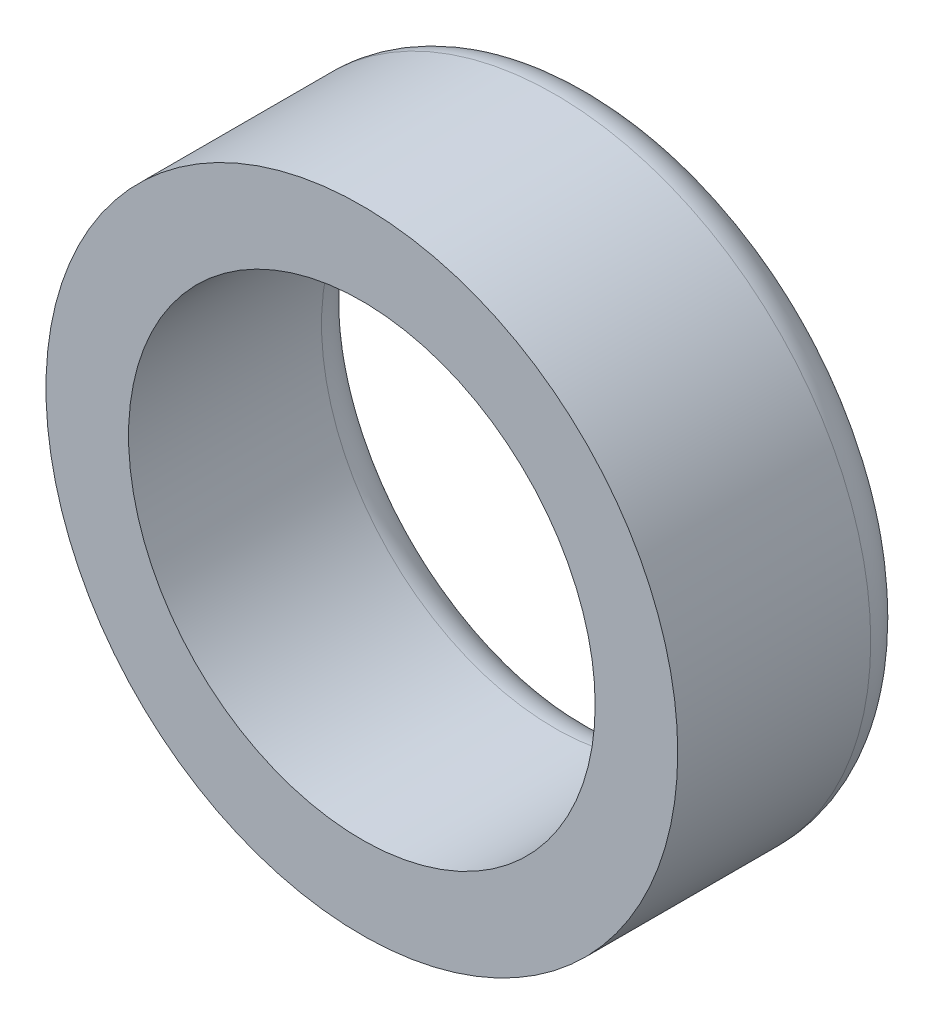
ISO-10303-21;
HEADER;
FILE_DESCRIPTION(('STEP AP214'),'2;1');
FILE_NAME('part.step','',(''),(''),'','','');
FILE_SCHEMA(('AUTOMOTIVE_DESIGN { 1 0 10303 214 1 1 1 1 }'));
ENDSEC;
DATA;
#1=APPLICATION_CONTEXT('core data for automotive mechanical design processes');
#2=APPLICATION_PROTOCOL_DEFINITION('international standard','automotive_design',2000,#1);
#3=PRODUCT_CONTEXT('',#1,'mechanical');
#4=PRODUCT('Part','Part','',(#3));
#5=PRODUCT_RELATED_PRODUCT_CATEGORY('part','',(#4));
#6=PRODUCT_DEFINITION_FORMATION('','',#4);
#7=PRODUCT_DEFINITION_CONTEXT('part definition',#1,'design');
#8=PRODUCT_DEFINITION('design','',#6,#7);
#9=PRODUCT_DEFINITION_SHAPE('','',#8);
#10=(LENGTH_UNIT() NAMED_UNIT(*) SI_UNIT(.MILLI.,.METRE.));
#11=(NAMED_UNIT(*) PLANE_ANGLE_UNIT() SI_UNIT($,.RADIAN.));
#12=(NAMED_UNIT(*) SI_UNIT($,.STERADIAN.) SOLID_ANGLE_UNIT());
#13=UNCERTAINTY_MEASURE_WITH_UNIT(LENGTH_MEASURE(1.E-05),#10,'distance_accuracy_value','');
#14=(GEOMETRIC_REPRESENTATION_CONTEXT(3) GLOBAL_UNCERTAINTY_ASSIGNED_CONTEXT((#13)) GLOBAL_UNIT_ASSIGNED_CONTEXT((#10,
#11,#12)) REPRESENTATION_CONTEXT('',''));
#15=CARTESIAN_POINT('',(0.,0.,0.));
#16=DIRECTION('',(0.,0.,1.));
#17=DIRECTION('',(1.,0.,0.));
#18=AXIS2_PLACEMENT_3D('',#15,#16,#17);
#19=CARTESIAN_POINT('',(0.,0.,-5.025));
#20=DIRECTION('',(0.,0.,1.));
#21=DIRECTION('',(1.,0.,0.));
#22=AXIS2_PLACEMENT_3D('',#19,#20,#21);
#23=TOROIDAL_SURFACE('',#22,7.15,1.075);
#24=CARTESIAN_POINT('',(0.,0.,-5.025));
#25=DIRECTION('',(0.,0.,1.));
#26=DIRECTION('',(1.,0.,0.));
#27=AXIS2_PLACEMENT_3D('',#24,#25,#26);
#28=CIRCLE('',#27,8.225);
#29=CARTESIAN_POINT('',(8.225,0.,-5.025));
#30=VERTEX_POINT('',#29);
#31=EDGE_CURVE('E44',#30,#30,#28,.T.);
#32=ORIENTED_EDGE('',*,*,#31,.F.);
#33=EDGE_LOOP('',(#32));
#34=FACE_BOUND('',#33,.T.);
#35=CARTESIAN_POINT('',(0.,0.,-5.025));
#36=DIRECTION('',(0.,0.,1.));
#37=DIRECTION('',(1.,0.,0.));
#38=AXIS2_PLACEMENT_3D('',#35,#36,#37);
#39=CIRCLE('',#38,6.075);
#40=CARTESIAN_POINT('',(6.075,0.,-5.025));
#41=VERTEX_POINT('',#40);
#42=EDGE_CURVE('E10',#41,#41,#39,.F.);
#43=ORIENTED_EDGE('',*,*,#42,.F.);
#44=EDGE_LOOP('',(#43));
#45=FACE_BOUND('',#44,.T.);
#46=ADVANCED_FACE('F37',(#34,#45),#23,.T.);
#47=CARTESIAN_POINT('',(0.,0.,-6.1));
#48=DIRECTION('',(0.,0.,1.));
#49=DIRECTION('',(1.,0.,0.));
#50=AXIS2_PLACEMENT_3D('',#47,#48,#49);
#51=CYLINDRICAL_SURFACE('',#50,8.225);
#52=ORIENTED_EDGE('',*,*,#31,.T.);
#53=EDGE_LOOP('',(#52));
#54=FACE_BOUND('',#53,.T.);
#55=CARTESIAN_POINT('',(0.,0.,0.));
#56=DIRECTION('',(0.,0.,1.));
#57=DIRECTION('',(1.,0.,0.));
#58=AXIS2_PLACEMENT_3D('',#55,#56,#57);
#59=CIRCLE('',#58,8.225);
#60=CARTESIAN_POINT('',(8.225,0.,0.));
#61=VERTEX_POINT('',#60);
#62=EDGE_CURVE('E48',#61,#61,#59,.T.);
#63=ORIENTED_EDGE('',*,*,#62,.F.);
#64=EDGE_LOOP('',(#63));
#65=FACE_BOUND('',#64,.T.);
#66=ADVANCED_FACE('F63',(#54,#65),#51,.T.);
#67=CARTESIAN_POINT('',(0.,0.,0.));
#68=DIRECTION('',(0.,0.,1.));
#69=DIRECTION('',(1.,0.,0.));
#70=AXIS2_PLACEMENT_3D('',#67,#68,#69);
#71=PLANE('',#70);
#72=CARTESIAN_POINT('',(0.,0.,0.));
#73=DIRECTION('',(0.,0.,1.));
#74=DIRECTION('',(1.,0.,0.));
#75=AXIS2_PLACEMENT_3D('',#72,#73,#74);
#76=CIRCLE('',#75,6.075);
#77=CARTESIAN_POINT('',(6.075,0.,0.));
#78=VERTEX_POINT('',#77);
#79=EDGE_CURVE('E52',#78,#78,#76,.T.);
#80=ORIENTED_EDGE('',*,*,#79,.F.);
#81=EDGE_LOOP('',(#80));
#82=FACE_BOUND('',#81,.T.);
#83=ORIENTED_EDGE('',*,*,#62,.T.);
#84=EDGE_LOOP('',(#83));
#85=FACE_BOUND('',#84,.T.);
#86=ADVANCED_FACE('F60',(#82,#85),#71,.T.);
#87=CARTESIAN_POINT('',(0.,0.,-6.1));
#88=DIRECTION('',(0.,0.,1.));
#89=DIRECTION('',(1.,0.,0.));
#90=AXIS2_PLACEMENT_3D('',#87,#88,#89);
#91=CYLINDRICAL_SURFACE('',#90,6.075);
#92=ORIENTED_EDGE('',*,*,#42,.T.);
#93=EDGE_LOOP('',(#92));
#94=FACE_BOUND('',#93,.T.);
#95=ORIENTED_EDGE('',*,*,#79,.T.);
#96=EDGE_LOOP('',(#95));
#97=FACE_BOUND('',#96,.T.);
#98=ADVANCED_FACE('F58',(#94,#97),#91,.F.);
#99=CLOSED_SHELL('',(#46,#66,#86,#98));
#100=MANIFOLD_SOLID_BREP('B2',#99);
#101=ADVANCED_BREP_SHAPE_REPRESENTATION('',(#18,#100),#14);
#102=SHAPE_DEFINITION_REPRESENTATION(#9,#101);
ENDSEC;
END-ISO-10303-21;
